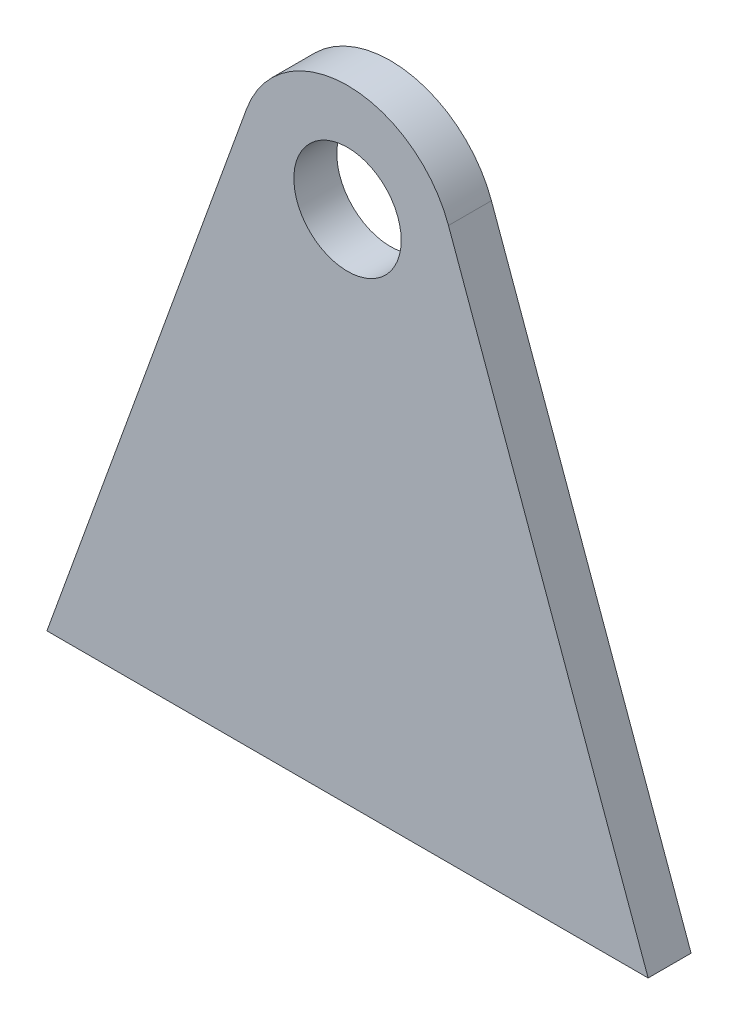
ISO-10303-21;
HEADER;
FILE_DESCRIPTION(('STEP AP214'),'2;1');
FILE_NAME('part.step','',(''),(''),'','','');
FILE_SCHEMA(('AUTOMOTIVE_DESIGN { 1 0 10303 214 1 1 1 1 }'));
ENDSEC;
DATA;
#1=APPLICATION_CONTEXT('core data for automotive mechanical design processes');
#2=APPLICATION_PROTOCOL_DEFINITION('international standard','automotive_design',2000,#1);
#3=PRODUCT_CONTEXT('',#1,'mechanical');
#4=PRODUCT('Part','Part','',(#3));
#5=PRODUCT_RELATED_PRODUCT_CATEGORY('part','',(#4));
#6=PRODUCT_DEFINITION_FORMATION('','',#4);
#7=PRODUCT_DEFINITION_CONTEXT('part definition',#1,'design');
#8=PRODUCT_DEFINITION('design','',#6,#7);
#9=PRODUCT_DEFINITION_SHAPE('','',#8);
#10=(LENGTH_UNIT() NAMED_UNIT(*) SI_UNIT(.MILLI.,.METRE.));
#11=(NAMED_UNIT(*) PLANE_ANGLE_UNIT() SI_UNIT($,.RADIAN.));
#12=(NAMED_UNIT(*) SI_UNIT($,.STERADIAN.) SOLID_ANGLE_UNIT());
#13=UNCERTAINTY_MEASURE_WITH_UNIT(LENGTH_MEASURE(1.E-05),#10,'distance_accuracy_value','');
#14=(GEOMETRIC_REPRESENTATION_CONTEXT(3) GLOBAL_UNCERTAINTY_ASSIGNED_CONTEXT((#13)) GLOBAL_UNIT_ASSIGNED_CONTEXT((#10,
#11,#12)) REPRESENTATION_CONTEXT('',''));
#15=CARTESIAN_POINT('',(0.,0.,0.));
#16=DIRECTION('',(0.,0.,1.));
#17=DIRECTION('',(1.,0.,0.));
#18=AXIS2_PLACEMENT_3D('',#15,#16,#17);
#19=CARTESIAN_POINT('',(-140.,0.,-20.));
#20=DIRECTION('',(-0.940351318262163,0.340204935652928,0.));
#21=DIRECTION('',(-0.340204935652928,-0.940351318262163,0.));
#22=AXIS2_PLACEMENT_3D('',#19,#20,#21);
#23=PLANE('',#22);
#24=DIRECTION('',(-0.340204935652928,-0.940351318262163,0.));
#25=VECTOR('',#24,1.);
#26=CARTESIAN_POINT('',(-140.,0.,0.));
#27=LINE('',#26,#25);
#28=CARTESIAN_POINT('',(-47.0175659131081,257.010246782646,0.));
#29=VERTEX_POINT('',#28);
#30=CARTESIAN_POINT('',(-140.,0.,0.));
#31=VERTEX_POINT('',#30);
#32=EDGE_CURVE('E98',#29,#31,#27,.T.);
#33=ORIENTED_EDGE('',*,*,#32,.F.);
#34=DIRECTION('',(0.,0.,1.));
#35=VECTOR('',#34,1.);
#36=CARTESIAN_POINT('',(-47.0175659131081,257.010246782646,-20.));
#37=LINE('',#36,#35);
#38=CARTESIAN_POINT('',(-47.0175659131081,257.010246782646,-20.));
#39=VERTEX_POINT('',#38);
#40=EDGE_CURVE('E11',#39,#29,#37,.T.);
#41=ORIENTED_EDGE('',*,*,#40,.F.);
#42=DIRECTION('',(-0.340204935652928,-0.940351318262163,0.));
#43=VECTOR('',#42,1.);
#44=CARTESIAN_POINT('',(-140.,0.,-20.));
#45=LINE('',#44,#43);
#46=CARTESIAN_POINT('',(-140.,0.,-20.));
#47=VERTEX_POINT('',#46);
#48=EDGE_CURVE('E91',#39,#47,#45,.T.);
#49=ORIENTED_EDGE('',*,*,#48,.T.);
#50=DIRECTION('',(0.,0.,1.));
#51=VECTOR('',#50,1.);
#52=CARTESIAN_POINT('',(-140.,0.,-20.));
#53=LINE('',#52,#51);
#54=EDGE_CURVE('E36',#47,#31,#53,.T.);
#55=ORIENTED_EDGE('',*,*,#54,.T.);
#56=EDGE_LOOP('',(#33,#41,#49,#55));
#57=FACE_BOUND('',#56,.T.);
#58=ADVANCED_FACE('F33',(#57),#23,.T.);
#59=CARTESIAN_POINT('',(0.,240.,-20.));
#60=DIRECTION('',(0.,0.,1.));
#61=DIRECTION('',(1.,0.,0.));
#62=AXIS2_PLACEMENT_3D('',#59,#60,#61);
#63=CYLINDRICAL_SURFACE('',#62,50.);
#64=CARTESIAN_POINT('',(0.,240.,0.));
#65=DIRECTION('',(0.,0.,1.));
#66=DIRECTION('',(-1.,0.,0.));
#67=AXIS2_PLACEMENT_3D('',#64,#65,#66);
#68=CIRCLE('',#67,50.);
#69=CARTESIAN_POINT('',(47.0175659131081,257.010246782646,0.));
#70=VERTEX_POINT('',#69);
#71=EDGE_CURVE('E93',#70,#29,#68,.T.);
#72=ORIENTED_EDGE('',*,*,#71,.F.);
#73=DIRECTION('',(0.,0.,1.));
#74=VECTOR('',#73,1.);
#75=CARTESIAN_POINT('',(47.0175659131081,257.010246782646,-20.));
#76=LINE('',#75,#74);
#77=CARTESIAN_POINT('',(47.0175659131081,257.010246782646,-20.));
#78=VERTEX_POINT('',#77);
#79=EDGE_CURVE('E42',#78,#70,#76,.T.);
#80=ORIENTED_EDGE('',*,*,#79,.F.);
#81=CARTESIAN_POINT('',(0.,240.,-20.));
#82=DIRECTION('',(0.,0.,1.));
#83=DIRECTION('',(-1.,0.,0.));
#84=AXIS2_PLACEMENT_3D('',#81,#82,#83);
#85=CIRCLE('',#84,50.);
#86=EDGE_CURVE('E88',#78,#39,#85,.T.);
#87=ORIENTED_EDGE('',*,*,#86,.T.);
#88=ORIENTED_EDGE('',*,*,#40,.T.);
#89=EDGE_LOOP('',(#72,#80,#87,#88));
#90=FACE_BOUND('',#89,.T.);
#91=ADVANCED_FACE('F109',(#90),#63,.T.);
#92=CARTESIAN_POINT('',(140.,0.,-20.));
#93=DIRECTION('',(0.940351318262163,0.340204935652928,0.));
#94=DIRECTION('',(-0.340204935652928,0.940351318262163,0.));
#95=AXIS2_PLACEMENT_3D('',#92,#93,#94);
#96=PLANE('',#95);
#97=DIRECTION('',(-0.340204935652928,0.940351318262163,0.));
#98=VECTOR('',#97,1.);
#99=CARTESIAN_POINT('',(140.,0.,0.));
#100=LINE('',#99,#98);
#101=CARTESIAN_POINT('',(140.,0.,0.));
#102=VERTEX_POINT('',#101);
#103=EDGE_CURVE('E83',#102,#70,#100,.T.);
#104=ORIENTED_EDGE('',*,*,#103,.F.);
#105=DIRECTION('',(0.,0.,1.));
#106=VECTOR('',#105,1.);
#107=CARTESIAN_POINT('',(140.,0.,-20.));
#108=LINE('',#107,#106);
#109=CARTESIAN_POINT('',(140.,0.,-20.));
#110=VERTEX_POINT('',#109);
#111=EDGE_CURVE('E78',#110,#102,#108,.T.);
#112=ORIENTED_EDGE('',*,*,#111,.F.);
#113=DIRECTION('',(-0.340204935652928,0.940351318262163,0.));
#114=VECTOR('',#113,1.);
#115=CARTESIAN_POINT('',(140.,0.,-20.));
#116=LINE('',#115,#114);
#117=EDGE_CURVE('E81',#110,#78,#116,.T.);
#118=ORIENTED_EDGE('',*,*,#117,.T.);
#119=ORIENTED_EDGE('',*,*,#79,.T.);
#120=EDGE_LOOP('',(#104,#112,#118,#119));
#121=FACE_BOUND('',#120,.T.);
#122=ADVANCED_FACE('F80',(#121),#96,.T.);
#123=CARTESIAN_POINT('',(-140.,0.,-20.));
#124=DIRECTION('',(0.,-1.,0.));
#125=DIRECTION('',(1.,0.,0.));
#126=AXIS2_PLACEMENT_3D('',#123,#124,#125);
#127=PLANE('',#126);
#128=DIRECTION('',(1.,0.,0.));
#129=VECTOR('',#128,1.);
#130=CARTESIAN_POINT('',(-140.,0.,0.));
#131=LINE('',#130,#129);
#132=EDGE_CURVE('E101',#31,#102,#131,.T.);
#133=ORIENTED_EDGE('',*,*,#132,.F.);
#134=ORIENTED_EDGE('',*,*,#54,.F.);
#135=DIRECTION('',(1.,0.,0.));
#136=VECTOR('',#135,1.);
#137=CARTESIAN_POINT('',(-140.,0.,-20.));
#138=LINE('',#137,#136);
#139=EDGE_CURVE('E87',#47,#110,#138,.T.);
#140=ORIENTED_EDGE('',*,*,#139,.T.);
#141=ORIENTED_EDGE('',*,*,#111,.T.);
#142=EDGE_LOOP('',(#133,#134,#140,#141));
#143=FACE_BOUND('',#142,.T.);
#144=ADVANCED_FACE('F90',(#143),#127,.T.);
#145=CARTESIAN_POINT('',(0.,240.,-20.));
#146=DIRECTION('',(0.,0.,-1.));
#147=DIRECTION('',(-1.,0.,0.));
#148=AXIS2_PLACEMENT_3D('',#145,#146,#147);
#149=PLANE('',#148);
#150=CARTESIAN_POINT('',(0.,240.,-20.));
#151=DIRECTION('',(0.,0.,1.));
#152=DIRECTION('',(1.,0.,0.));
#153=AXIS2_PLACEMENT_3D('',#150,#151,#152);
#154=CIRCLE('',#153,25.);
#155=CARTESIAN_POINT('',(25.,240.,-20.));
#156=VERTEX_POINT('',#155);
#157=EDGE_CURVE('E102',#156,#156,#154,.T.);
#158=ORIENTED_EDGE('',*,*,#157,.T.);
#159=EDGE_LOOP('',(#158));
#160=FACE_BOUND('',#159,.T.);
#161=ORIENTED_EDGE('',*,*,#48,.F.);
#162=ORIENTED_EDGE('',*,*,#86,.F.);
#163=ORIENTED_EDGE('',*,*,#117,.F.);
#164=ORIENTED_EDGE('',*,*,#139,.F.);
#165=EDGE_LOOP('',(#161,#162,#163,#164));
#166=FACE_BOUND('',#165,.T.);
#167=ADVANCED_FACE('F86',(#160,#166),#149,.T.);
#168=CARTESIAN_POINT('',(0.,240.,0.));
#169=DIRECTION('',(0.,0.,-1.));
#170=DIRECTION('',(-1.,0.,0.));
#171=AXIS2_PLACEMENT_3D('',#168,#169,#170);
#172=PLANE('',#171);
#173=CARTESIAN_POINT('',(0.,240.,0.));
#174=DIRECTION('',(0.,0.,1.));
#175=DIRECTION('',(1.,0.,0.));
#176=AXIS2_PLACEMENT_3D('',#173,#174,#175);
#177=CIRCLE('',#176,25.);
#178=CARTESIAN_POINT('',(25.,240.,0.));
#179=VERTEX_POINT('',#178);
#180=EDGE_CURVE('E139',#179,#179,#177,.T.);
#181=ORIENTED_EDGE('',*,*,#180,.F.);
#182=EDGE_LOOP('',(#181));
#183=FACE_BOUND('',#182,.T.);
#184=ORIENTED_EDGE('',*,*,#32,.T.);
#185=ORIENTED_EDGE('',*,*,#132,.T.);
#186=ORIENTED_EDGE('',*,*,#103,.T.);
#187=ORIENTED_EDGE('',*,*,#71,.T.);
#188=EDGE_LOOP('',(#184,#185,#186,#187));
#189=FACE_BOUND('',#188,.T.);
#190=ADVANCED_FACE('F108',(#183,#189),#172,.F.);
#191=CARTESIAN_POINT('',(0.,240.,-20.));
#192=DIRECTION('',(0.,0.,1.));
#193=DIRECTION('',(1.,0.,0.));
#194=AXIS2_PLACEMENT_3D('',#191,#192,#193);
#195=CYLINDRICAL_SURFACE('',#194,25.);
#196=ORIENTED_EDGE('',*,*,#157,.F.);
#197=EDGE_LOOP('',(#196));
#198=FACE_BOUND('',#197,.T.);
#199=ORIENTED_EDGE('',*,*,#180,.T.);
#200=EDGE_LOOP('',(#199));
#201=FACE_BOUND('',#200,.T.);
#202=ADVANCED_FACE('F127',(#198,#201),#195,.F.);
#203=CLOSED_SHELL('',(#58,#91,#122,#144,#167,#190,#202));
#204=MANIFOLD_SOLID_BREP('B2',#203);
#205=ADVANCED_BREP_SHAPE_REPRESENTATION('',(#18,#204),#14);
#206=SHAPE_DEFINITION_REPRESENTATION(#9,#205);
ENDSEC;
END-ISO-10303-21;
